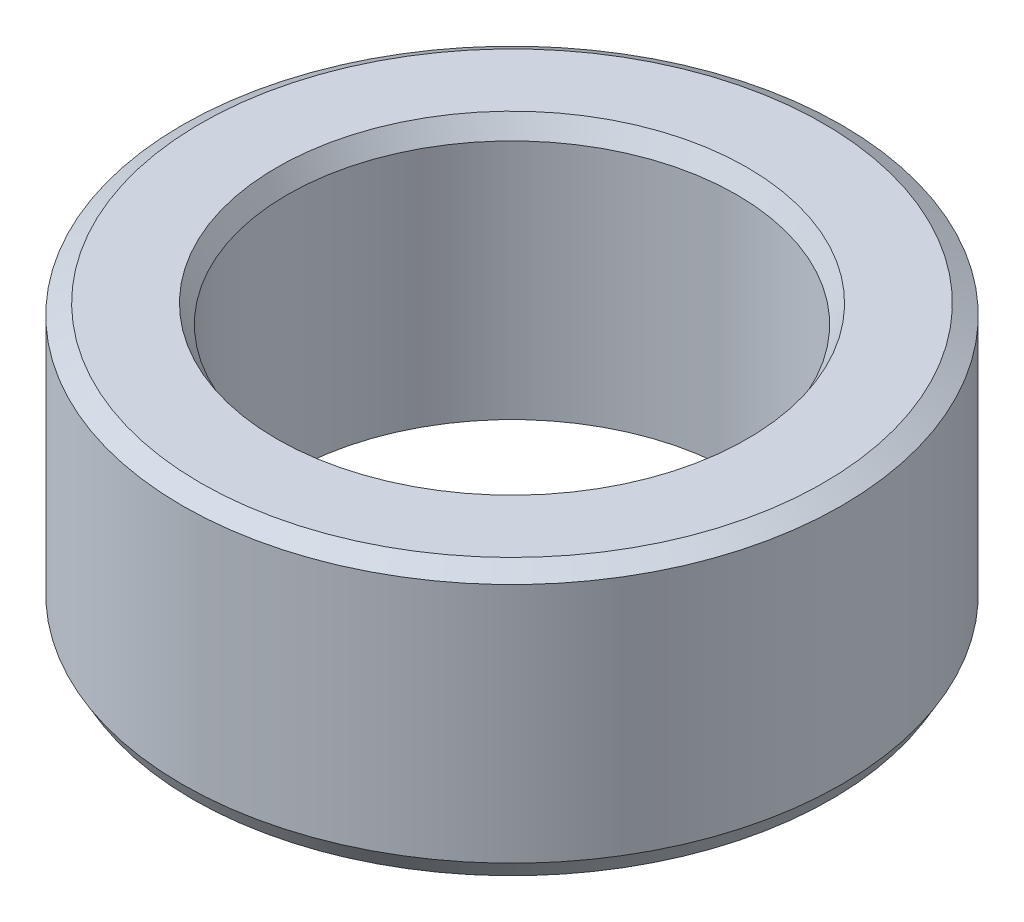
ISO-10303-21;
HEADER;
FILE_DESCRIPTION(('STEP AP214'),'2;1');
FILE_NAME('part.step','',(''),(''),'','','');
FILE_SCHEMA(('AUTOMOTIVE_DESIGN { 1 0 10303 214 1 1 1 1 }'));
ENDSEC;
DATA;
#1=APPLICATION_CONTEXT('core data for automotive mechanical design processes');
#2=APPLICATION_PROTOCOL_DEFINITION('international standard','automotive_design',2000,#1);
#3=PRODUCT_CONTEXT('',#1,'mechanical');
#4=PRODUCT('Part','Part','',(#3));
#5=PRODUCT_RELATED_PRODUCT_CATEGORY('part','',(#4));
#6=PRODUCT_DEFINITION_FORMATION('','',#4);
#7=PRODUCT_DEFINITION_CONTEXT('part definition',#1,'design');
#8=PRODUCT_DEFINITION('design','',#6,#7);
#9=PRODUCT_DEFINITION_SHAPE('','',#8);
#10=(LENGTH_UNIT() NAMED_UNIT(*) SI_UNIT(.MILLI.,.METRE.));
#11=(NAMED_UNIT(*) PLANE_ANGLE_UNIT() SI_UNIT($,.RADIAN.));
#12=(NAMED_UNIT(*) SI_UNIT($,.STERADIAN.) SOLID_ANGLE_UNIT());
#13=UNCERTAINTY_MEASURE_WITH_UNIT(LENGTH_MEASURE(1.E-05),#10,'distance_accuracy_value','');
#14=(GEOMETRIC_REPRESENTATION_CONTEXT(3) GLOBAL_UNCERTAINTY_ASSIGNED_CONTEXT((#13)) GLOBAL_UNIT_ASSIGNED_CONTEXT((#10,
#11,#12)) REPRESENTATION_CONTEXT('',''));
#15=CARTESIAN_POINT('',(0.,0.,0.));
#16=DIRECTION('',(0.,0.,1.));
#17=DIRECTION('',(1.,0.,0.));
#18=AXIS2_PLACEMENT_3D('',#15,#16,#17);
#19=CARTESIAN_POINT('',(0.,36.8757582798472,0.));
#20=DIRECTION('',(0.,-1.,0.));
#21=DIRECTION('',(0.,0.,-1.));
#22=AXIS2_PLACEMENT_3D('',#19,#20,#21);
#23=CYLINDRICAL_SURFACE('',#22,45.);
#24=CARTESIAN_POINT('',(0.,2.49594793571462,0.));
#25=DIRECTION('',(0.,1.,0.));
#26=DIRECTION('',(0.,0.,1.));
#27=AXIS2_PLACEMENT_3D('',#24,#25,#26);
#28=CIRCLE('',#27,45.);
#29=CARTESIAN_POINT('',(0.,2.49594793571462,45.));
#30=VERTEX_POINT('',#29);
#31=EDGE_CURVE('E10',#30,#30,#28,.T.);
#32=ORIENTED_EDGE('',*,*,#31,.T.);
#33=EDGE_LOOP('',(#32));
#34=FACE_BOUND('',#33,.T.);
#35=CARTESIAN_POINT('',(0.,35.4347220672791,0.));
#36=DIRECTION('',(0.,1.,0.));
#37=DIRECTION('',(0.,0.,1.));
#38=AXIS2_PLACEMENT_3D('',#35,#36,#37);
#39=CIRCLE('',#38,45.);
#40=CARTESIAN_POINT('',(0.,35.4347220672791,45.));
#41=VERTEX_POINT('',#40);
#42=EDGE_CURVE('E50',#41,#41,#39,.F.);
#43=ORIENTED_EDGE('',*,*,#42,.T.);
#44=EDGE_LOOP('',(#43));
#45=FACE_BOUND('',#44,.T.);
#46=ADVANCED_FACE('F39',(#34,#45),#23,.T.);
#47=CARTESIAN_POINT('',(0.,36.8757582798472,0.));
#48=DIRECTION('',(0.,1.,0.));
#49=DIRECTION('',(0.,0.,1.));
#50=AXIS2_PLACEMENT_3D('',#47,#48,#49);
#51=PLANE('',#50);
#52=CARTESIAN_POINT('',(0.,36.8757582798472,0.));
#53=DIRECTION('',(0.,1.,0.));
#54=DIRECTION('',(0.,0.,1.));
#55=AXIS2_PLACEMENT_3D('',#52,#53,#54);
#56=CIRCLE('',#55,32.0995010063666);
#57=CARTESIAN_POINT('',(0.,36.8757582798472,32.0995010063666));
#58=VERTEX_POINT('',#57);
#59=EDGE_CURVE('E58',#58,#58,#56,.F.);
#60=ORIENTED_EDGE('',*,*,#59,.T.);
#61=EDGE_LOOP('',(#60));
#62=FACE_BOUND('',#61,.T.);
#63=CARTESIAN_POINT('',(0.,36.8757582798472,0.));
#64=DIRECTION('',(0.,1.,0.));
#65=DIRECTION('',(0.,0.,1.));
#66=AXIS2_PLACEMENT_3D('',#63,#64,#65);
#67=CIRCLE('',#66,42.5040520642854);
#68=CARTESIAN_POINT('',(0.,36.8757582798472,42.5040520642854));
#69=VERTEX_POINT('',#68);
#70=EDGE_CURVE('E61',#69,#69,#67,.T.);
#71=ORIENTED_EDGE('',*,*,#70,.T.);
#72=EDGE_LOOP('',(#71));
#73=FACE_BOUND('',#72,.T.);
#74=ADVANCED_FACE('F88',(#62,#73),#51,.T.);
#75=CARTESIAN_POINT('',(0.,0.,0.));
#76=DIRECTION('',(0.,1.,0.));
#77=DIRECTION('',(0.,0.,1.));
#78=AXIS2_PLACEMENT_3D('',#75,#76,#77);
#79=PLANE('',#78);
#80=CARTESIAN_POINT('',(0.,0.,0.));
#81=DIRECTION('',(0.,1.,0.));
#82=DIRECTION('',(0.,0.,1.));
#83=AXIS2_PLACEMENT_3D('',#80,#81,#82);
#84=CIRCLE('',#83,33.1544127295132);
#85=CARTESIAN_POINT('',(0.,0.,33.1544127295132));
#86=VERTEX_POINT('',#85);
#87=EDGE_CURVE('E51',#86,#86,#84,.T.);
#88=ORIENTED_EDGE('',*,*,#87,.T.);
#89=EDGE_LOOP('',(#88));
#90=FACE_BOUND('',#89,.T.);
#91=CARTESIAN_POINT('',(0.,0.,0.));
#92=DIRECTION('',(0.,1.,0.));
#93=DIRECTION('',(0.,0.,1.));
#94=AXIS2_PLACEMENT_3D('',#91,#92,#93);
#95=CIRCLE('',#94,43.5589637874319);
#96=CARTESIAN_POINT('',(0.,0.,43.5589637874319));
#97=VERTEX_POINT('',#96);
#98=EDGE_CURVE('E54',#97,#97,#95,.F.);
#99=ORIENTED_EDGE('',*,*,#98,.T.);
#100=EDGE_LOOP('',(#99));
#101=FACE_BOUND('',#100,.T.);
#102=ADVANCED_FACE('F83',(#90,#101),#79,.F.);
#103=CARTESIAN_POINT('',(0.,36.8757582798472,0.));
#104=DIRECTION('',(0.,-1.,0.));
#105=DIRECTION('',(0.,0.,-1.));
#106=AXIS2_PLACEMENT_3D('',#103,#104,#105);
#107=CYLINDRICAL_SURFACE('',#106,30.6584647937985);
#108=CARTESIAN_POINT('',(0.,34.3798103441326,0.));
#109=DIRECTION('',(0.,1.,0.));
#110=DIRECTION('',(0.,0.,1.));
#111=AXIS2_PLACEMENT_3D('',#108,#109,#110);
#112=CIRCLE('',#111,30.6584647937985);
#113=CARTESIAN_POINT('',(0.,34.3798103441326,30.6584647937985));
#114=VERTEX_POINT('',#113);
#115=EDGE_CURVE('E67',#114,#114,#112,.T.);
#116=ORIENTED_EDGE('',*,*,#115,.T.);
#117=EDGE_LOOP('',(#116));
#118=FACE_BOUND('',#117,.T.);
#119=CARTESIAN_POINT('',(0.,1.44103621256816,0.));
#120=DIRECTION('',(0.,1.,0.));
#121=DIRECTION('',(0.,0.,1.));
#122=AXIS2_PLACEMENT_3D('',#119,#120,#121);
#123=CIRCLE('',#122,30.6584647937985);
#124=CARTESIAN_POINT('',(0.,1.44103621256816,30.6584647937985));
#125=VERTEX_POINT('',#124);
#126=EDGE_CURVE('E69',#125,#125,#123,.F.);
#127=ORIENTED_EDGE('',*,*,#126,.T.);
#128=EDGE_LOOP('',(#127));
#129=FACE_BOUND('',#128,.T.);
#130=ADVANCED_FACE('F71',(#118,#129),#107,.F.);
#131=CARTESIAN_POINT('',(0.,34.3798103441326,0.));
#132=DIRECTION('',(0.,1.,0.));
#133=DIRECTION('',(0.,0.,1.));
#134=AXIS2_PLACEMENT_3D('',#131,#132,#133);
#135=CONICAL_SURFACE('',#134,30.6584647937985,0.523598775598302);
#136=ORIENTED_EDGE('',*,*,#59,.F.);
#137=EDGE_LOOP('',(#136));
#138=FACE_BOUND('',#137,.T.);
#139=ORIENTED_EDGE('',*,*,#115,.F.);
#140=EDGE_LOOP('',(#139));
#141=FACE_BOUND('',#140,.T.);
#142=ADVANCED_FACE('F77',(#138,#141),#135,.F.);
#143=CARTESIAN_POINT('',(0.,0.,0.));
#144=DIRECTION('',(0.,-1.,0.));
#145=DIRECTION('',(0.,0.,-1.));
#146=AXIS2_PLACEMENT_3D('',#143,#144,#145);
#147=CONICAL_SURFACE('',#146,33.1544127295132,1.04719755119659);
#148=ORIENTED_EDGE('',*,*,#126,.F.);
#149=EDGE_LOOP('',(#148));
#150=FACE_BOUND('',#149,.T.);
#151=ORIENTED_EDGE('',*,*,#87,.F.);
#152=EDGE_LOOP('',(#151));
#153=FACE_BOUND('',#152,.T.);
#154=ADVANCED_FACE('F73',(#150,#153),#147,.F.);
#155=CARTESIAN_POINT('',(0.,2.49594793571462,0.));
#156=DIRECTION('',(0.,1.,0.));
#157=DIRECTION('',(0.,0.,1.));
#158=AXIS2_PLACEMENT_3D('',#155,#156,#157);
#159=CONICAL_SURFACE('',#158,45.,0.523598775598303);
#160=ORIENTED_EDGE('',*,*,#98,.F.);
#161=EDGE_LOOP('',(#160));
#162=FACE_BOUND('',#161,.T.);
#163=ORIENTED_EDGE('',*,*,#31,.F.);
#164=EDGE_LOOP('',(#163));
#165=FACE_BOUND('',#164,.T.);
#166=ADVANCED_FACE('F76',(#162,#165),#159,.T.);
#167=CARTESIAN_POINT('',(0.,36.8757582798472,0.));
#168=DIRECTION('',(0.,-1.,0.));
#169=DIRECTION('',(0.,0.,-1.));
#170=AXIS2_PLACEMENT_3D('',#167,#168,#169);
#171=CONICAL_SURFACE('',#170,42.5040520642854,1.04719755119659);
#172=ORIENTED_EDGE('',*,*,#42,.F.);
#173=EDGE_LOOP('',(#172));
#174=FACE_BOUND('',#173,.T.);
#175=ORIENTED_EDGE('',*,*,#70,.F.);
#176=EDGE_LOOP('',(#175));
#177=FACE_BOUND('',#176,.T.);
#178=ADVANCED_FACE('F45',(#174,#177),#171,.T.);
#179=CLOSED_SHELL('',(#46,#74,#102,#130,#142,#154,#166,#178));
#180=MANIFOLD_SOLID_BREP('B2',#179);
#181=ADVANCED_BREP_SHAPE_REPRESENTATION('',(#18,#180),#14);
#182=SHAPE_DEFINITION_REPRESENTATION(#9,#181);
ENDSEC;
END-ISO-10303-21;
